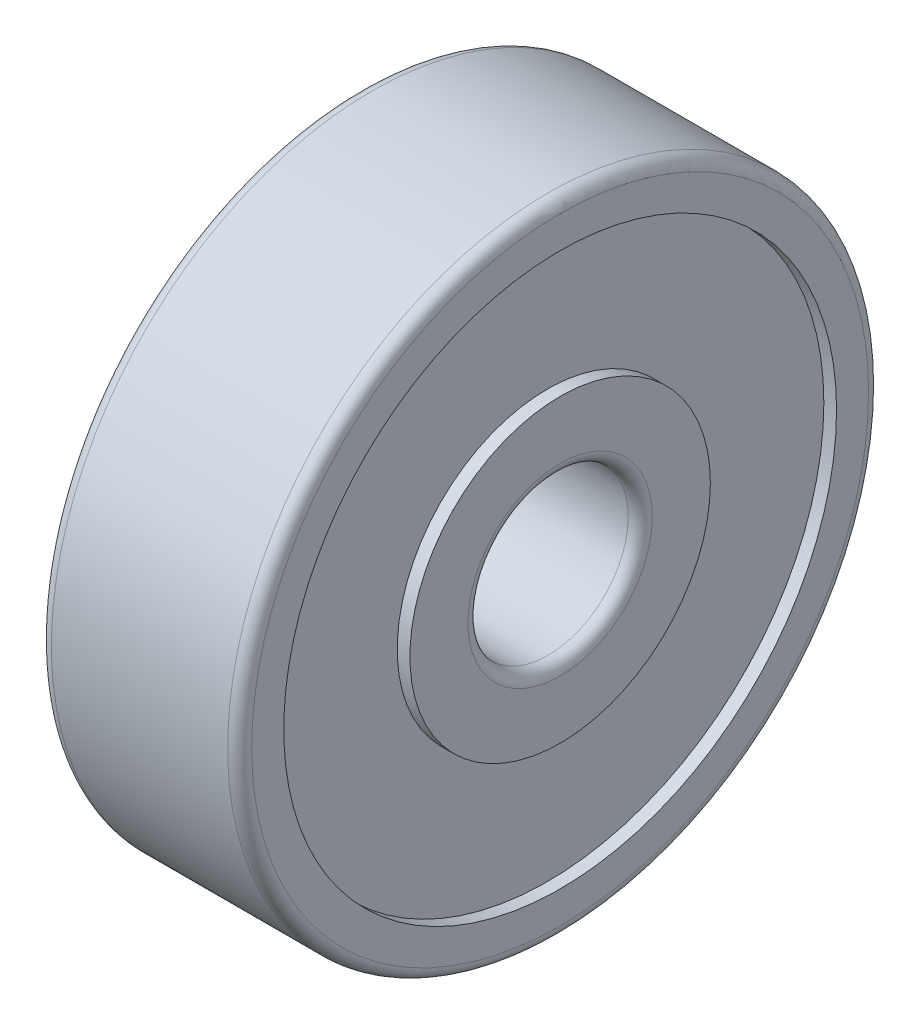
ISO-10303-21;
HEADER;
FILE_DESCRIPTION(('STEP AP214'),'2;1');
FILE_NAME('part.step','',(''),(''),'','','');
FILE_SCHEMA(('AUTOMOTIVE_DESIGN { 1 0 10303 214 1 1 1 1 }'));
ENDSEC;
DATA;
#1=APPLICATION_CONTEXT('core data for automotive mechanical design processes');
#2=APPLICATION_PROTOCOL_DEFINITION('international standard','automotive_design',2000,#1);
#3=PRODUCT_CONTEXT('',#1,'mechanical');
#4=PRODUCT('Part','Part','',(#3));
#5=PRODUCT_RELATED_PRODUCT_CATEGORY('part','',(#4));
#6=PRODUCT_DEFINITION_FORMATION('','',#4);
#7=PRODUCT_DEFINITION_CONTEXT('part definition',#1,'design');
#8=PRODUCT_DEFINITION('design','',#6,#7);
#9=PRODUCT_DEFINITION_SHAPE('','',#8);
#10=(LENGTH_UNIT() NAMED_UNIT(*) SI_UNIT(.MILLI.,.METRE.));
#11=(NAMED_UNIT(*) PLANE_ANGLE_UNIT() SI_UNIT($,.RADIAN.));
#12=(NAMED_UNIT(*) SI_UNIT($,.STERADIAN.) SOLID_ANGLE_UNIT());
#13=UNCERTAINTY_MEASURE_WITH_UNIT(LENGTH_MEASURE(1.E-05),#10,'distance_accuracy_value','');
#14=(GEOMETRIC_REPRESENTATION_CONTEXT(3) GLOBAL_UNCERTAINTY_ASSIGNED_CONTEXT((#13)) GLOBAL_UNIT_ASSIGNED_CONTEXT((#10,
#11,#12)) REPRESENTATION_CONTEXT('',''));
#15=CARTESIAN_POINT('',(0.,0.,0.));
#16=DIRECTION('',(0.,0.,1.));
#17=DIRECTION('',(1.,0.,0.));
#18=AXIS2_PLACEMENT_3D('',#15,#16,#17);
#19=CARTESIAN_POINT('',(-0.00135526613234169,0.,0.));
#20=DIRECTION('',(1.,0.,0.));
#21=DIRECTION('',(0.,0.,-1.));
#22=AXIS2_PLACEMENT_3D('',#19,#20,#21);
#23=CYLINDRICAL_SURFACE('',#22,3.75);
#24=CARTESIAN_POINT('',(0.,0.,0.));
#25=DIRECTION('',(1.,0.,0.));
#26=DIRECTION('',(0.,0.,-1.));
#27=AXIS2_PLACEMENT_3D('',#24,#25,#26);
#28=CIRCLE('',#27,3.75);
#29=CARTESIAN_POINT('',(0.,0.,-3.75));
#30=VERTEX_POINT('',#29);
#31=EDGE_CURVE('E10',#30,#30,#28,.T.);
#32=ORIENTED_EDGE('',*,*,#31,.T.);
#33=EDGE_LOOP('',(#32));
#34=FACE_BOUND('',#33,.T.);
#35=CARTESIAN_POINT('',(0.317,0.,0.));
#36=DIRECTION('',(1.,0.,0.));
#37=DIRECTION('',(0.,0.,-1.));
#38=AXIS2_PLACEMENT_3D('',#35,#36,#37);
#39=CIRCLE('',#38,3.75);
#40=CARTESIAN_POINT('',(0.317,0.,-3.75));
#41=VERTEX_POINT('',#40);
#42=EDGE_CURVE('E83',#41,#41,#39,.T.);
#43=ORIENTED_EDGE('',*,*,#42,.F.);
#44=EDGE_LOOP('',(#43));
#45=FACE_BOUND('',#44,.T.);
#46=ADVANCED_FACE('F31',(#34,#45),#23,.T.);
#47=CARTESIAN_POINT('',(0.,3.75,0.));
#48=DIRECTION('',(-1.,0.,0.));
#49=DIRECTION('',(0.,0.,1.));
#50=AXIS2_PLACEMENT_3D('',#47,#48,#49);
#51=PLANE('',#50);
#52=CARTESIAN_POINT('',(0.,0.,0.));
#53=DIRECTION('',(1.,0.,0.));
#54=DIRECTION('',(0.,0.,-1.));
#55=AXIS2_PLACEMENT_3D('',#52,#53,#54);
#56=CIRCLE('',#55,2.29999999999994);
#57=CARTESIAN_POINT('',(0.,0.,-2.29999999999994));
#58=VERTEX_POINT('',#57);
#59=EDGE_CURVE('E37',#58,#58,#56,.T.);
#60=ORIENTED_EDGE('',*,*,#59,.T.);
#61=EDGE_LOOP('',(#60));
#62=FACE_BOUND('',#61,.T.);
#63=ORIENTED_EDGE('',*,*,#31,.F.);
#64=EDGE_LOOP('',(#63));
#65=FACE_BOUND('',#64,.T.);
#66=ADVANCED_FACE('F91',(#62,#65),#51,.T.);
#67=CARTESIAN_POINT('',(0.299999999999939,0.,0.));
#68=DIRECTION('',(1.,0.,0.));
#69=DIRECTION('',(0.,0.,-1.));
#70=AXIS2_PLACEMENT_3D('',#67,#68,#69);
#71=TOROIDAL_SURFACE('',#70,2.29999999999994,0.299999999999939);
#72=CARTESIAN_POINT('',(0.299999999999939,0.,0.));
#73=DIRECTION('',(1.,0.,0.));
#74=DIRECTION('',(0.,0.,-1.));
#75=AXIS2_PLACEMENT_3D('',#72,#73,#74);
#76=CIRCLE('',#75,2.);
#77=CARTESIAN_POINT('',(0.299999999999939,0.,-2.));
#78=VERTEX_POINT('',#77);
#79=EDGE_CURVE('E41',#78,#78,#76,.T.);
#80=ORIENTED_EDGE('',*,*,#79,.T.);
#81=EDGE_LOOP('',(#80));
#82=FACE_BOUND('',#81,.T.);
#83=ORIENTED_EDGE('',*,*,#59,.F.);
#84=EDGE_LOOP('',(#83));
#85=FACE_BOUND('',#84,.T.);
#86=ADVANCED_FACE('F95',(#82,#85),#71,.T.);
#87=CARTESIAN_POINT('',(-0.00135526613234169,0.,0.));
#88=DIRECTION('',(1.,0.,0.));
#89=DIRECTION('',(0.,0.,-1.));
#90=AXIS2_PLACEMENT_3D('',#87,#88,#89);
#91=CYLINDRICAL_SURFACE('',#90,2.);
#92=CARTESIAN_POINT('',(4.70000000000012,0.,0.));
#93=DIRECTION('',(1.,0.,0.));
#94=DIRECTION('',(0.,0.,-1.));
#95=AXIS2_PLACEMENT_3D('',#92,#93,#94);
#96=CIRCLE('',#95,2.);
#97=CARTESIAN_POINT('',(4.70000000000012,0.,-2.));
#98=VERTEX_POINT('',#97);
#99=EDGE_CURVE('E45',#98,#98,#96,.T.);
#100=ORIENTED_EDGE('',*,*,#99,.T.);
#101=EDGE_LOOP('',(#100));
#102=FACE_BOUND('',#101,.T.);
#103=ORIENTED_EDGE('',*,*,#79,.F.);
#104=EDGE_LOOP('',(#103));
#105=FACE_BOUND('',#104,.T.);
#106=ADVANCED_FACE('F99',(#102,#105),#91,.F.);
#107=CARTESIAN_POINT('',(4.70000000000012,0.,0.));
#108=DIRECTION('',(1.,0.,0.));
#109=DIRECTION('',(0.,0.,-1.));
#110=AXIS2_PLACEMENT_3D('',#107,#108,#109);
#111=TOROIDAL_SURFACE('',#110,2.29999999999988,0.299999999999878);
#112=CARTESIAN_POINT('',(5.,0.,0.));
#113=DIRECTION('',(1.,0.,0.));
#114=DIRECTION('',(0.,0.,-1.));
#115=AXIS2_PLACEMENT_3D('',#112,#113,#114);
#116=CIRCLE('',#115,2.29999999999988);
#117=CARTESIAN_POINT('',(5.,0.,-2.29999999999988));
#118=VERTEX_POINT('',#117);
#119=EDGE_CURVE('E50',#118,#118,#116,.T.);
#120=ORIENTED_EDGE('',*,*,#119,.T.);
#121=EDGE_LOOP('',(#120));
#122=FACE_BOUND('',#121,.T.);
#123=ORIENTED_EDGE('',*,*,#99,.F.);
#124=EDGE_LOOP('',(#123));
#125=FACE_BOUND('',#124,.T.);
#126=ADVANCED_FACE('F106',(#122,#125),#111,.T.);
#127=CARTESIAN_POINT('',(5.,2.29999999999988,0.));
#128=DIRECTION('',(1.,0.,0.));
#129=DIRECTION('',(0.,0.,-1.));
#130=AXIS2_PLACEMENT_3D('',#127,#128,#129);
#131=PLANE('',#130);
#132=CARTESIAN_POINT('',(5.,0.,0.));
#133=DIRECTION('',(1.,0.,0.));
#134=DIRECTION('',(0.,0.,-1.));
#135=AXIS2_PLACEMENT_3D('',#132,#133,#134);
#136=CIRCLE('',#135,3.75);
#137=CARTESIAN_POINT('',(5.,0.,-3.75));
#138=VERTEX_POINT('',#137);
#139=EDGE_CURVE('E53',#138,#138,#136,.T.);
#140=ORIENTED_EDGE('',*,*,#139,.T.);
#141=EDGE_LOOP('',(#140));
#142=FACE_BOUND('',#141,.T.);
#143=ORIENTED_EDGE('',*,*,#119,.F.);
#144=EDGE_LOOP('',(#143));
#145=FACE_BOUND('',#144,.T.);
#146=ADVANCED_FACE('F110',(#142,#145),#131,.T.);
#147=CARTESIAN_POINT('',(-0.00135526613234169,0.,0.));
#148=DIRECTION('',(1.,0.,0.));
#149=DIRECTION('',(0.,0.,-1.));
#150=AXIS2_PLACEMENT_3D('',#147,#148,#149);
#151=CYLINDRICAL_SURFACE('',#150,3.75);
#152=CARTESIAN_POINT('',(4.683,0.,0.));
#153=DIRECTION('',(1.,0.,0.));
#154=DIRECTION('',(0.,0.,-1.));
#155=AXIS2_PLACEMENT_3D('',#152,#153,#154);
#156=CIRCLE('',#155,3.75);
#157=CARTESIAN_POINT('',(4.683,0.,-3.75));
#158=VERTEX_POINT('',#157);
#159=EDGE_CURVE('E56',#158,#158,#156,.T.);
#160=ORIENTED_EDGE('',*,*,#159,.T.);
#161=EDGE_LOOP('',(#160));
#162=FACE_BOUND('',#161,.T.);
#163=ORIENTED_EDGE('',*,*,#139,.F.);
#164=EDGE_LOOP('',(#163));
#165=FACE_BOUND('',#164,.T.);
#166=ADVANCED_FACE('F114',(#162,#165),#151,.T.);
#167=CARTESIAN_POINT('',(4.683,3.75,0.));
#168=DIRECTION('',(1.,0.,0.));
#169=DIRECTION('',(0.,0.,-1.));
#170=AXIS2_PLACEMENT_3D('',#167,#168,#169);
#171=PLANE('',#170);
#172=CARTESIAN_POINT('',(4.683,0.,0.));
#173=DIRECTION('',(1.,0.,0.));
#174=DIRECTION('',(0.,0.,-1.));
#175=AXIS2_PLACEMENT_3D('',#172,#173,#174);
#176=CIRCLE('',#175,6.9);
#177=CARTESIAN_POINT('',(4.683,0.,-6.9));
#178=VERTEX_POINT('',#177);
#179=EDGE_CURVE('E59',#178,#178,#176,.T.);
#180=ORIENTED_EDGE('',*,*,#179,.T.);
#181=EDGE_LOOP('',(#180));
#182=FACE_BOUND('',#181,.T.);
#183=ORIENTED_EDGE('',*,*,#159,.F.);
#184=EDGE_LOOP('',(#183));
#185=FACE_BOUND('',#184,.T.);
#186=ADVANCED_FACE('F118',(#182,#185),#171,.T.);
#187=CARTESIAN_POINT('',(-0.00135526613234169,0.,0.));
#188=DIRECTION('',(1.,0.,0.));
#189=DIRECTION('',(0.,0.,-1.));
#190=AXIS2_PLACEMENT_3D('',#187,#188,#189);
#191=CYLINDRICAL_SURFACE('',#190,6.9);
#192=CARTESIAN_POINT('',(5.,0.,0.));
#193=DIRECTION('',(1.,0.,0.));
#194=DIRECTION('',(0.,0.,-1.));
#195=AXIS2_PLACEMENT_3D('',#192,#193,#194);
#196=CIRCLE('',#195,6.9);
#197=CARTESIAN_POINT('',(5.,0.,-6.9));
#198=VERTEX_POINT('',#197);
#199=EDGE_CURVE('E62',#198,#198,#196,.T.);
#200=ORIENTED_EDGE('',*,*,#199,.T.);
#201=EDGE_LOOP('',(#200));
#202=FACE_BOUND('',#201,.T.);
#203=ORIENTED_EDGE('',*,*,#179,.F.);
#204=EDGE_LOOP('',(#203));
#205=FACE_BOUND('',#204,.T.);
#206=ADVANCED_FACE('F122',(#202,#205),#191,.F.);
#207=CARTESIAN_POINT('',(5.,6.9,0.));
#208=DIRECTION('',(1.,0.,0.));
#209=DIRECTION('',(0.,0.,-1.));
#210=AXIS2_PLACEMENT_3D('',#207,#208,#209);
#211=PLANE('',#210);
#212=CARTESIAN_POINT('',(5.,0.,0.));
#213=DIRECTION('',(1.,0.,0.));
#214=DIRECTION('',(0.,0.,-1.));
#215=AXIS2_PLACEMENT_3D('',#212,#213,#214);
#216=CIRCLE('',#215,7.70000000000012);
#217=CARTESIAN_POINT('',(5.,0.,-7.70000000000012));
#218=VERTEX_POINT('',#217);
#219=EDGE_CURVE('E65',#218,#218,#216,.T.);
#220=ORIENTED_EDGE('',*,*,#219,.T.);
#221=EDGE_LOOP('',(#220));
#222=FACE_BOUND('',#221,.T.);
#223=ORIENTED_EDGE('',*,*,#199,.F.);
#224=EDGE_LOOP('',(#223));
#225=FACE_BOUND('',#224,.T.);
#226=ADVANCED_FACE('F126',(#222,#225),#211,.T.);
#227=CARTESIAN_POINT('',(4.70000000000012,0.,0.));
#228=DIRECTION('',(1.,0.,0.));
#229=DIRECTION('',(0.,0.,-1.));
#230=AXIS2_PLACEMENT_3D('',#227,#228,#229);
#231=TOROIDAL_SURFACE('',#230,7.70000000000012,0.299999999999877);
#232=CARTESIAN_POINT('',(4.70000000000012,0.,0.));
#233=DIRECTION('',(1.,0.,0.));
#234=DIRECTION('',(0.,0.,-1.));
#235=AXIS2_PLACEMENT_3D('',#232,#233,#234);
#236=CIRCLE('',#235,8.);
#237=CARTESIAN_POINT('',(4.70000000000012,0.,-8.));
#238=VERTEX_POINT('',#237);
#239=EDGE_CURVE('E68',#238,#238,#236,.T.);
#240=ORIENTED_EDGE('',*,*,#239,.T.);
#241=EDGE_LOOP('',(#240));
#242=FACE_BOUND('',#241,.T.);
#243=ORIENTED_EDGE('',*,*,#219,.F.);
#244=EDGE_LOOP('',(#243));
#245=FACE_BOUND('',#244,.T.);
#246=ADVANCED_FACE('F130',(#242,#245),#231,.T.);
#247=CARTESIAN_POINT('',(-0.00135526613234169,0.,0.));
#248=DIRECTION('',(1.,0.,0.));
#249=DIRECTION('',(0.,0.,-1.));
#250=AXIS2_PLACEMENT_3D('',#247,#248,#249);
#251=CYLINDRICAL_SURFACE('',#250,8.);
#252=CARTESIAN_POINT('',(0.3,0.,0.));
#253=DIRECTION('',(1.,0.,0.));
#254=DIRECTION('',(0.,0.,-1.));
#255=AXIS2_PLACEMENT_3D('',#252,#253,#254);
#256=CIRCLE('',#255,8.);
#257=CARTESIAN_POINT('',(0.3,0.,-8.));
#258=VERTEX_POINT('',#257);
#259=EDGE_CURVE('E71',#258,#258,#256,.T.);
#260=ORIENTED_EDGE('',*,*,#259,.T.);
#261=EDGE_LOOP('',(#260));
#262=FACE_BOUND('',#261,.T.);
#263=ORIENTED_EDGE('',*,*,#239,.F.);
#264=EDGE_LOOP('',(#263));
#265=FACE_BOUND('',#264,.T.);
#266=ADVANCED_FACE('F134',(#262,#265),#251,.T.);
#267=CARTESIAN_POINT('',(0.299999999999937,0.,0.));
#268=DIRECTION('',(1.,0.,0.));
#269=DIRECTION('',(0.,0.,-1.));
#270=AXIS2_PLACEMENT_3D('',#267,#268,#269);
#271=TOROIDAL_SURFACE('',#270,7.7,0.299999999999968);
#272=CARTESIAN_POINT('',(0.,0.,0.));
#273=DIRECTION('',(1.,0.,0.));
#274=DIRECTION('',(0.,0.,-1.));
#275=AXIS2_PLACEMENT_3D('',#272,#273,#274);
#276=CIRCLE('',#275,7.7);
#277=CARTESIAN_POINT('',(0.,0.,-7.7));
#278=VERTEX_POINT('',#277);
#279=EDGE_CURVE('E74',#278,#278,#276,.T.);
#280=ORIENTED_EDGE('',*,*,#279,.T.);
#281=EDGE_LOOP('',(#280));
#282=FACE_BOUND('',#281,.T.);
#283=ORIENTED_EDGE('',*,*,#259,.F.);
#284=EDGE_LOOP('',(#283));
#285=FACE_BOUND('',#284,.T.);
#286=ADVANCED_FACE('F138',(#282,#285),#271,.T.);
#287=CARTESIAN_POINT('',(0.,7.7,0.));
#288=DIRECTION('',(-1.,0.,0.));
#289=DIRECTION('',(0.,0.,1.));
#290=AXIS2_PLACEMENT_3D('',#287,#288,#289);
#291=PLANE('',#290);
#292=CARTESIAN_POINT('',(0.,0.,0.));
#293=DIRECTION('',(1.,0.,0.));
#294=DIRECTION('',(0.,0.,-1.));
#295=AXIS2_PLACEMENT_3D('',#292,#293,#294);
#296=CIRCLE('',#295,6.9);
#297=CARTESIAN_POINT('',(0.,0.,-6.9));
#298=VERTEX_POINT('',#297);
#299=EDGE_CURVE('E77',#298,#298,#296,.T.);
#300=ORIENTED_EDGE('',*,*,#299,.T.);
#301=EDGE_LOOP('',(#300));
#302=FACE_BOUND('',#301,.T.);
#303=ORIENTED_EDGE('',*,*,#279,.F.);
#304=EDGE_LOOP('',(#303));
#305=FACE_BOUND('',#304,.T.);
#306=ADVANCED_FACE('F142',(#302,#305),#291,.T.);
#307=CARTESIAN_POINT('',(-0.00135526613234169,0.,0.));
#308=DIRECTION('',(1.,0.,0.));
#309=DIRECTION('',(0.,0.,-1.));
#310=AXIS2_PLACEMENT_3D('',#307,#308,#309);
#311=CYLINDRICAL_SURFACE('',#310,6.9);
#312=CARTESIAN_POINT('',(0.317,0.,0.));
#313=DIRECTION('',(1.,0.,0.));
#314=DIRECTION('',(0.,0.,-1.));
#315=AXIS2_PLACEMENT_3D('',#312,#313,#314);
#316=CIRCLE('',#315,6.9);
#317=CARTESIAN_POINT('',(0.317,0.,-6.9));
#318=VERTEX_POINT('',#317);
#319=EDGE_CURVE('E80',#318,#318,#316,.T.);
#320=ORIENTED_EDGE('',*,*,#319,.T.);
#321=EDGE_LOOP('',(#320));
#322=FACE_BOUND('',#321,.T.);
#323=ORIENTED_EDGE('',*,*,#299,.F.);
#324=EDGE_LOOP('',(#323));
#325=FACE_BOUND('',#324,.T.);
#326=ADVANCED_FACE('F146',(#322,#325),#311,.F.);
#327=CARTESIAN_POINT('',(0.317,6.9,0.));
#328=DIRECTION('',(-1.,0.,0.));
#329=DIRECTION('',(0.,0.,1.));
#330=AXIS2_PLACEMENT_3D('',#327,#328,#329);
#331=PLANE('',#330);
#332=ORIENTED_EDGE('',*,*,#42,.T.);
#333=EDGE_LOOP('',(#332));
#334=FACE_BOUND('',#333,.T.);
#335=ORIENTED_EDGE('',*,*,#319,.F.);
#336=EDGE_LOOP('',(#335));
#337=FACE_BOUND('',#336,.T.);
#338=ADVANCED_FACE('F87',(#334,#337),#331,.T.);
#339=CLOSED_SHELL('',(#46,#66,#86,#106,#126,#146,#166,#186,#206,#226,#246,#266,#286,#306,#326,#338));
#340=MANIFOLD_SOLID_BREP('B2',#339);
#341=ADVANCED_BREP_SHAPE_REPRESENTATION('',(#18,#340),#14);
#342=SHAPE_DEFINITION_REPRESENTATION(#9,#341);
ENDSEC;
END-ISO-10303-21;
